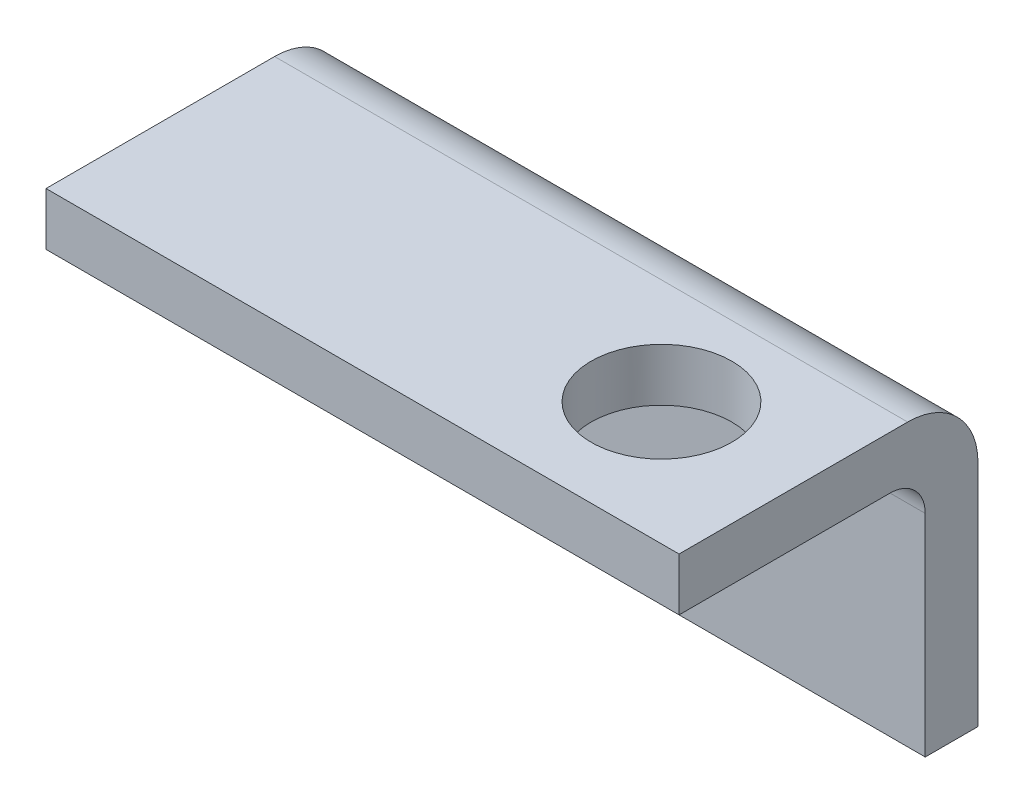
ISO-10303-21;
HEADER;
FILE_DESCRIPTION(('STEP AP214'),'2;1');
FILE_NAME('part.step','',(''),(''),'','','');
FILE_SCHEMA(('AUTOMOTIVE_DESIGN { 1 0 10303 214 1 1 1 1 }'));
ENDSEC;
DATA;
#1=APPLICATION_CONTEXT('core data for automotive mechanical design processes');
#2=APPLICATION_PROTOCOL_DEFINITION('international standard','automotive_design',2000,#1);
#3=PRODUCT_CONTEXT('',#1,'mechanical');
#4=PRODUCT('Part','Part','',(#3));
#5=PRODUCT_RELATED_PRODUCT_CATEGORY('part','',(#4));
#6=PRODUCT_DEFINITION_FORMATION('','',#4);
#7=PRODUCT_DEFINITION_CONTEXT('part definition',#1,'design');
#8=PRODUCT_DEFINITION('design','',#6,#7);
#9=PRODUCT_DEFINITION_SHAPE('','',#8);
#10=(LENGTH_UNIT() NAMED_UNIT(*) SI_UNIT(.MILLI.,.METRE.));
#11=(NAMED_UNIT(*) PLANE_ANGLE_UNIT() SI_UNIT($,.RADIAN.));
#12=(NAMED_UNIT(*) SI_UNIT($,.STERADIAN.) SOLID_ANGLE_UNIT());
#13=UNCERTAINTY_MEASURE_WITH_UNIT(LENGTH_MEASURE(1.E-05),#10,'distance_accuracy_value','');
#14=(GEOMETRIC_REPRESENTATION_CONTEXT(3) GLOBAL_UNCERTAINTY_ASSIGNED_CONTEXT((#13)) GLOBAL_UNIT_ASSIGNED_CONTEXT((#10,
#11,#12)) REPRESENTATION_CONTEXT('',''));
#15=CARTESIAN_POINT('',(0.,0.,0.));
#16=DIRECTION('',(0.,0.,1.));
#17=DIRECTION('',(1.,0.,0.));
#18=AXIS2_PLACEMENT_3D('',#15,#16,#17);
#19=CARTESIAN_POINT('',(18.,8.5,3.));
#20=DIRECTION('',(-1.,0.,0.));
#21=DIRECTION('',(0.,-1.,0.));
#22=AXIS2_PLACEMENT_3D('',#19,#20,#21);
#23=PLANE('',#22);
#24=DIRECTION('',(0.,1.,0.));
#25=VECTOR('',#24,1.);
#26=CARTESIAN_POINT('',(18.,8.5,0.));
#27=LINE('',#26,#25);
#28=CARTESIAN_POINT('',(18.,-8.5,0.));
#29=VERTEX_POINT('',#28);
#30=CARTESIAN_POINT('',(18.,4.5,0.));
#31=VERTEX_POINT('',#30);
#32=EDGE_CURVE('E138',#29,#31,#27,.T.);
#33=ORIENTED_EDGE('',*,*,#32,.T.);
#34=CARTESIAN_POINT('',(18.,4.5,4.));
#35=DIRECTION('',(-1.,0.,0.));
#36=DIRECTION('',(0.,-1.,0.));
#37=AXIS2_PLACEMENT_3D('',#34,#35,#36);
#38=CIRCLE('',#37,4.);
#39=CARTESIAN_POINT('',(18.,8.5,4.));
#40=VERTEX_POINT('',#39);
#41=EDGE_CURVE('E11',#31,#40,#38,.F.);
#42=ORIENTED_EDGE('',*,*,#41,.T.);
#43=DIRECTION('',(0.,0.,-1.));
#44=VECTOR('',#43,1.);
#45=CARTESIAN_POINT('',(18.,8.5,3.));
#46=LINE('',#45,#44);
#47=CARTESIAN_POINT('',(18.,8.5,17.));
#48=VERTEX_POINT('',#47);
#49=EDGE_CURVE('E110',#48,#40,#46,.T.);
#50=ORIENTED_EDGE('',*,*,#49,.F.);
#51=DIRECTION('',(0.,1.,0.));
#52=VECTOR('',#51,1.);
#53=CARTESIAN_POINT('',(18.,5.50000000000001,17.));
#54=LINE('',#53,#52);
#55=CARTESIAN_POINT('',(18.,5.50000000000001,17.));
#56=VERTEX_POINT('',#55);
#57=EDGE_CURVE('E125',#56,#48,#54,.T.);
#58=ORIENTED_EDGE('',*,*,#57,.F.);
#59=DIRECTION('',(0.,0.,-1.));
#60=VECTOR('',#59,1.);
#61=CARTESIAN_POINT('',(18.,5.50000000000001,17.));
#62=LINE('',#61,#60);
#63=CARTESIAN_POINT('',(18.,5.50000000000001,5.));
#64=VERTEX_POINT('',#63);
#65=EDGE_CURVE('E134',#56,#64,#62,.T.);
#66=ORIENTED_EDGE('',*,*,#65,.T.);
#67=CARTESIAN_POINT('',(18.,3.50000000000001,5.));
#68=DIRECTION('',(-1.,0.,0.));
#69=DIRECTION('',(0.,-1.,0.));
#70=AXIS2_PLACEMENT_3D('',#67,#68,#69);
#71=CIRCLE('',#70,2.);
#72=CARTESIAN_POINT('',(18.,3.50000000000001,3.));
#73=VERTEX_POINT('',#72);
#74=EDGE_CURVE('E162',#64,#73,#71,.T.);
#75=ORIENTED_EDGE('',*,*,#74,.T.);
#76=DIRECTION('',(0.,1.,0.));
#77=VECTOR('',#76,1.);
#78=CARTESIAN_POINT('',(18.,8.5,3.));
#79=LINE('',#78,#77);
#80=CARTESIAN_POINT('',(18.,-8.5,3.));
#81=VERTEX_POINT('',#80);
#82=EDGE_CURVE('E139',#81,#73,#79,.T.);
#83=ORIENTED_EDGE('',*,*,#82,.F.);
#84=DIRECTION('',(0.,0.,-1.));
#85=VECTOR('',#84,1.);
#86=CARTESIAN_POINT('',(18.,-8.5,3.));
#87=LINE('',#86,#85);
#88=EDGE_CURVE('E147',#81,#29,#87,.T.);
#89=ORIENTED_EDGE('',*,*,#88,.T.);
#90=EDGE_LOOP('',(#33,#42,#50,#58,#66,#75,#83,#89));
#91=FACE_BOUND('',#90,.T.);
#92=ADVANCED_FACE('F37',(#91),#23,.F.);
#93=CARTESIAN_POINT('',(-18.,8.5,3.));
#94=DIRECTION('',(0.,-1.,0.));
#95=DIRECTION('',(0.,0.,-1.));
#96=AXIS2_PLACEMENT_3D('',#93,#94,#95);
#97=PLANE('',#96);
#98=CARTESIAN_POINT('',(10.,8.5,10.));
#99=DIRECTION('',(0.,-1.,0.));
#100=DIRECTION('',(0.,0.,-1.));
#101=AXIS2_PLACEMENT_3D('',#98,#99,#100);
#102=CIRCLE('',#101,4.);
#103=CARTESIAN_POINT('',(10.,8.5,6.));
#104=VERTEX_POINT('',#103);
#105=EDGE_CURVE('E128',#104,#104,#102,.T.);
#106=ORIENTED_EDGE('',*,*,#105,.T.);
#107=EDGE_LOOP('',(#106));
#108=FACE_BOUND('',#107,.T.);
#109=ORIENTED_EDGE('',*,*,#49,.T.);
#110=DIRECTION('',(-1.,0.,0.));
#111=VECTOR('',#110,1.);
#112=CARTESIAN_POINT('',(-18.,8.5,4.));
#113=LINE('',#112,#111);
#114=CARTESIAN_POINT('',(-18.,8.5,4.));
#115=VERTEX_POINT('',#114);
#116=EDGE_CURVE('E109',#40,#115,#113,.T.);
#117=ORIENTED_EDGE('',*,*,#116,.T.);
#118=DIRECTION('',(0.,0.,-1.));
#119=VECTOR('',#118,1.);
#120=CARTESIAN_POINT('',(-18.,8.5,3.));
#121=LINE('',#120,#119);
#122=CARTESIAN_POINT('',(-18.,8.5,17.));
#123=VERTEX_POINT('',#122);
#124=EDGE_CURVE('E102',#123,#115,#121,.T.);
#125=ORIENTED_EDGE('',*,*,#124,.F.);
#126=DIRECTION('',(-1.,0.,0.));
#127=VECTOR('',#126,1.);
#128=CARTESIAN_POINT('',(18.,8.5,17.));
#129=LINE('',#128,#127);
#130=EDGE_CURVE('E107',#48,#123,#129,.T.);
#131=ORIENTED_EDGE('',*,*,#130,.F.);
#132=EDGE_LOOP('',(#109,#117,#125,#131));
#133=FACE_BOUND('',#132,.T.);
#134=ADVANCED_FACE('F105',(#108,#133),#97,.F.);
#135=CARTESIAN_POINT('',(-18.,8.5,3.));
#136=DIRECTION('',(1.,0.,0.));
#137=DIRECTION('',(0.,0.,-1.));
#138=AXIS2_PLACEMENT_3D('',#135,#136,#137);
#139=PLANE('',#138);
#140=ORIENTED_EDGE('',*,*,#124,.T.);
#141=CARTESIAN_POINT('',(-18.,4.5,4.));
#142=DIRECTION('',(1.,0.,0.));
#143=DIRECTION('',(0.,0.,-1.));
#144=AXIS2_PLACEMENT_3D('',#141,#142,#143);
#145=CIRCLE('',#144,4.);
#146=CARTESIAN_POINT('',(-18.,4.5,0.));
#147=VERTEX_POINT('',#146);
#148=EDGE_CURVE('E60',#115,#147,#145,.F.);
#149=ORIENTED_EDGE('',*,*,#148,.T.);
#150=DIRECTION('',(0.,-1.,0.));
#151=VECTOR('',#150,1.);
#152=CARTESIAN_POINT('',(-18.,8.5,0.));
#153=LINE('',#152,#151);
#154=CARTESIAN_POINT('',(-18.,-8.5,0.));
#155=VERTEX_POINT('',#154);
#156=EDGE_CURVE('E149',#147,#155,#153,.T.);
#157=ORIENTED_EDGE('',*,*,#156,.T.);
#158=DIRECTION('',(0.,0.,-1.));
#159=VECTOR('',#158,1.);
#160=CARTESIAN_POINT('',(-18.,-8.5,3.));
#161=LINE('',#160,#159);
#162=CARTESIAN_POINT('',(-18.,-8.5,3.));
#163=VERTEX_POINT('',#162);
#164=EDGE_CURVE('E111',#163,#155,#161,.T.);
#165=ORIENTED_EDGE('',*,*,#164,.F.);
#166=DIRECTION('',(0.,-1.,0.));
#167=VECTOR('',#166,1.);
#168=CARTESIAN_POINT('',(-18.,8.5,3.));
#169=LINE('',#168,#167);
#170=CARTESIAN_POINT('',(-18.,3.5,3.));
#171=VERTEX_POINT('',#170);
#172=EDGE_CURVE('E142',#171,#163,#169,.T.);
#173=ORIENTED_EDGE('',*,*,#172,.F.);
#174=CARTESIAN_POINT('',(-18.,3.5,5.));
#175=DIRECTION('',(1.,0.,0.));
#176=DIRECTION('',(0.,0.,-1.));
#177=AXIS2_PLACEMENT_3D('',#174,#175,#176);
#178=CIRCLE('',#177,2.);
#179=CARTESIAN_POINT('',(-18.,5.5,5.));
#180=VERTEX_POINT('',#179);
#181=EDGE_CURVE('E164',#171,#180,#178,.T.);
#182=ORIENTED_EDGE('',*,*,#181,.T.);
#183=DIRECTION('',(0.,0.,-1.));
#184=VECTOR('',#183,1.);
#185=CARTESIAN_POINT('',(-18.,5.5,17.));
#186=LINE('',#185,#184);
#187=CARTESIAN_POINT('',(-18.,5.5,17.));
#188=VERTEX_POINT('',#187);
#189=EDGE_CURVE('E117',#188,#180,#186,.T.);
#190=ORIENTED_EDGE('',*,*,#189,.F.);
#191=DIRECTION('',(0.,-1.,0.));
#192=VECTOR('',#191,1.);
#193=CARTESIAN_POINT('',(-18.,8.5,17.));
#194=LINE('',#193,#192);
#195=EDGE_CURVE('E114',#123,#188,#194,.T.);
#196=ORIENTED_EDGE('',*,*,#195,.F.);
#197=EDGE_LOOP('',(#140,#149,#157,#165,#173,#182,#190,#196));
#198=FACE_BOUND('',#197,.T.);
#199=ADVANCED_FACE('F115',(#198),#139,.F.);
#200=CARTESIAN_POINT('',(-18.,-8.5,3.));
#201=DIRECTION('',(0.,1.,0.));
#202=DIRECTION('',(0.,0.,1.));
#203=AXIS2_PLACEMENT_3D('',#200,#201,#202);
#204=PLANE('',#203);
#205=DIRECTION('',(1.,0.,0.));
#206=VECTOR('',#205,1.);
#207=CARTESIAN_POINT('',(-18.,-8.5,0.));
#208=LINE('',#207,#206);
#209=EDGE_CURVE('E143',#155,#29,#208,.T.);
#210=ORIENTED_EDGE('',*,*,#209,.T.);
#211=ORIENTED_EDGE('',*,*,#88,.F.);
#212=DIRECTION('',(1.,0.,0.));
#213=VECTOR('',#212,1.);
#214=CARTESIAN_POINT('',(-18.,-8.5,3.));
#215=LINE('',#214,#213);
#216=EDGE_CURVE('E145',#163,#81,#215,.T.);
#217=ORIENTED_EDGE('',*,*,#216,.F.);
#218=ORIENTED_EDGE('',*,*,#164,.T.);
#219=EDGE_LOOP('',(#210,#211,#217,#218));
#220=FACE_BOUND('',#219,.T.);
#221=ADVANCED_FACE('F185',(#220),#204,.F.);
#222=CARTESIAN_POINT('',(0.,0.,3.));
#223=DIRECTION('',(0.,0.,1.));
#224=DIRECTION('',(1.,0.,0.));
#225=AXIS2_PLACEMENT_3D('',#222,#223,#224);
#226=PLANE('',#225);
#227=CARTESIAN_POINT('',(-10.,-1.5,3.));
#228=DIRECTION('',(0.,0.,1.));
#229=DIRECTION('',(1.,0.,0.));
#230=AXIS2_PLACEMENT_3D('',#227,#228,#229);
#231=CIRCLE('',#230,4.);
#232=CARTESIAN_POINT('',(-6.,-1.5,3.));
#233=VERTEX_POINT('',#232);
#234=EDGE_CURVE('E229',#233,#233,#231,.T.);
#235=ORIENTED_EDGE('',*,*,#234,.F.);
#236=EDGE_LOOP('',(#235));
#237=FACE_BOUND('',#236,.T.);
#238=ORIENTED_EDGE('',*,*,#82,.T.);
#239=DIRECTION('',(1.,0.,0.));
#240=VECTOR('',#239,1.);
#241=CARTESIAN_POINT('',(0.,3.50000000000001,3.));
#242=LINE('',#241,#240);
#243=EDGE_CURVE('E160',#73,#171,#242,.F.);
#244=ORIENTED_EDGE('',*,*,#243,.T.);
#245=ORIENTED_EDGE('',*,*,#172,.T.);
#246=ORIENTED_EDGE('',*,*,#216,.T.);
#247=EDGE_LOOP('',(#238,#244,#245,#246));
#248=FACE_BOUND('',#247,.T.);
#249=ADVANCED_FACE('F181',(#237,#248),#226,.T.);
#250=CARTESIAN_POINT('',(0.,0.,0.));
#251=DIRECTION('',(0.,0.,1.));
#252=DIRECTION('',(1.,0.,0.));
#253=AXIS2_PLACEMENT_3D('',#250,#251,#252);
#254=PLANE('',#253);
#255=CARTESIAN_POINT('',(-10.,-1.5,0.));
#256=DIRECTION('',(0.,0.,1.));
#257=DIRECTION('',(1.,0.,0.));
#258=AXIS2_PLACEMENT_3D('',#255,#256,#257);
#259=CIRCLE('',#258,4.);
#260=CARTESIAN_POINT('',(-6.,-1.5,0.));
#261=VERTEX_POINT('',#260);
#262=EDGE_CURVE('E232',#261,#261,#259,.T.);
#263=ORIENTED_EDGE('',*,*,#262,.T.);
#264=EDGE_LOOP('',(#263));
#265=FACE_BOUND('',#264,.T.);
#266=ORIENTED_EDGE('',*,*,#156,.F.);
#267=DIRECTION('',(-1.,0.,0.));
#268=VECTOR('',#267,1.);
#269=CARTESIAN_POINT('',(0.,4.5,0.));
#270=LINE('',#269,#268);
#271=EDGE_CURVE('E46',#147,#31,#270,.F.);
#272=ORIENTED_EDGE('',*,*,#271,.T.);
#273=ORIENTED_EDGE('',*,*,#32,.F.);
#274=ORIENTED_EDGE('',*,*,#209,.F.);
#275=EDGE_LOOP('',(#266,#272,#273,#274));
#276=FACE_BOUND('',#275,.T.);
#277=ADVANCED_FACE('F188',(#265,#276),#254,.F.);
#278=CARTESIAN_POINT('',(-18.,5.5,17.));
#279=DIRECTION('',(0.,1.,0.));
#280=DIRECTION('',(-1.,0.,0.));
#281=AXIS2_PLACEMENT_3D('',#278,#279,#280);
#282=PLANE('',#281);
#283=CARTESIAN_POINT('',(10.,5.50000000000001,10.));
#284=DIRECTION('',(0.,1.,0.));
#285=DIRECTION('',(-1.,0.,0.));
#286=AXIS2_PLACEMENT_3D('',#283,#284,#285);
#287=CIRCLE('',#286,4.);
#288=CARTESIAN_POINT('',(6.,5.50000000000001,10.));
#289=VERTEX_POINT('',#288);
#290=EDGE_CURVE('E41',#289,#289,#287,.T.);
#291=ORIENTED_EDGE('',*,*,#290,.T.);
#292=EDGE_LOOP('',(#291));
#293=FACE_BOUND('',#292,.T.);
#294=ORIENTED_EDGE('',*,*,#189,.T.);
#295=DIRECTION('',(1.,0.,0.));
#296=VECTOR('',#295,1.);
#297=CARTESIAN_POINT('',(-18.,5.5,5.));
#298=LINE('',#297,#296);
#299=EDGE_CURVE('E157',#180,#64,#298,.T.);
#300=ORIENTED_EDGE('',*,*,#299,.T.);
#301=ORIENTED_EDGE('',*,*,#65,.F.);
#302=DIRECTION('',(1.,0.,0.));
#303=VECTOR('',#302,1.);
#304=CARTESIAN_POINT('',(-18.,5.5,17.));
#305=LINE('',#304,#303);
#306=EDGE_CURVE('E120',#188,#56,#305,.T.);
#307=ORIENTED_EDGE('',*,*,#306,.F.);
#308=EDGE_LOOP('',(#294,#300,#301,#307));
#309=FACE_BOUND('',#308,.T.);
#310=ADVANCED_FACE('F175',(#293,#309),#282,.F.);
#311=CARTESIAN_POINT('',(0.,0.,17.));
#312=DIRECTION('',(0.,0.,1.));
#313=DIRECTION('',(1.,0.,0.));
#314=AXIS2_PLACEMENT_3D('',#311,#312,#313);
#315=PLANE('',#314);
#316=ORIENTED_EDGE('',*,*,#130,.T.);
#317=ORIENTED_EDGE('',*,*,#195,.T.);
#318=ORIENTED_EDGE('',*,*,#306,.T.);
#319=ORIENTED_EDGE('',*,*,#57,.T.);
#320=EDGE_LOOP('',(#316,#317,#318,#319));
#321=FACE_BOUND('',#320,.T.);
#322=ADVANCED_FACE('F123',(#321),#315,.T.);
#323=CARTESIAN_POINT('',(-18.,3.5,5.));
#324=DIRECTION('',(1.,0.,0.));
#325=DIRECTION('',(0.,1.,0.));
#326=AXIS2_PLACEMENT_3D('',#323,#324,#325);
#327=CYLINDRICAL_SURFACE('',#326,2.);
#328=ORIENTED_EDGE('',*,*,#181,.F.);
#329=ORIENTED_EDGE('',*,*,#243,.F.);
#330=ORIENTED_EDGE('',*,*,#74,.F.);
#331=ORIENTED_EDGE('',*,*,#299,.F.);
#332=EDGE_LOOP('',(#328,#329,#330,#331));
#333=FACE_BOUND('',#332,.T.);
#334=ADVANCED_FACE('F177',(#333),#327,.F.);
#335=CARTESIAN_POINT('',(-18.,4.5,4.));
#336=DIRECTION('',(-1.,0.,0.));
#337=DIRECTION('',(0.,0.,1.));
#338=AXIS2_PLACEMENT_3D('',#335,#336,#337);
#339=CYLINDRICAL_SURFACE('',#338,4.);
#340=ORIENTED_EDGE('',*,*,#41,.F.);
#341=ORIENTED_EDGE('',*,*,#271,.F.);
#342=ORIENTED_EDGE('',*,*,#148,.F.);
#343=ORIENTED_EDGE('',*,*,#116,.F.);
#344=EDGE_LOOP('',(#340,#341,#342,#343));
#345=FACE_BOUND('',#344,.T.);
#346=ADVANCED_FACE('F39',(#345),#339,.T.);
#347=CARTESIAN_POINT('',(10.,8.5,10.));
#348=DIRECTION('',(0.,-1.,0.));
#349=DIRECTION('',(0.,0.,-1.));
#350=AXIS2_PLACEMENT_3D('',#347,#348,#349);
#351=CYLINDRICAL_SURFACE('',#350,4.);
#352=ORIENTED_EDGE('',*,*,#105,.F.);
#353=EDGE_LOOP('',(#352));
#354=FACE_BOUND('',#353,.T.);
#355=ORIENTED_EDGE('',*,*,#290,.F.);
#356=EDGE_LOOP('',(#355));
#357=FACE_BOUND('',#356,.T.);
#358=ADVANCED_FACE('F191',(#354,#357),#351,.F.);
#359=CARTESIAN_POINT('',(-10.,-1.5,0.));
#360=DIRECTION('',(0.,0.,1.));
#361=DIRECTION('',(1.,0.,0.));
#362=AXIS2_PLACEMENT_3D('',#359,#360,#361);
#363=CYLINDRICAL_SURFACE('',#362,4.);
#364=ORIENTED_EDGE('',*,*,#234,.T.);
#365=EDGE_LOOP('',(#364));
#366=FACE_BOUND('',#365,.T.);
#367=ORIENTED_EDGE('',*,*,#262,.F.);
#368=EDGE_LOOP('',(#367));
#369=FACE_BOUND('',#368,.T.);
#370=ADVANCED_FACE('F196',(#366,#369),#363,.F.);
#371=CLOSED_SHELL('',(#92,#134,#199,#221,#249,#277,#310,#322,#334,#346,#358,#370));
#372=MANIFOLD_SOLID_BREP('B2',#371);
#373=ADVANCED_BREP_SHAPE_REPRESENTATION('',(#18,#372),#14);
#374=SHAPE_DEFINITION_REPRESENTATION(#9,#373);
ENDSEC;
END-ISO-10303-21;
